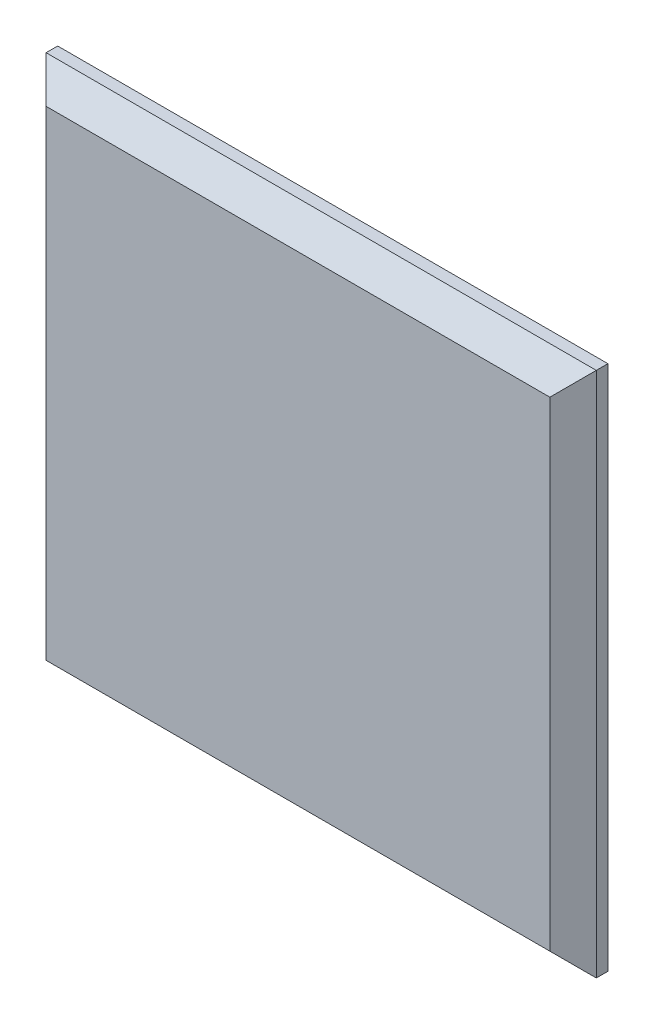
ISO-10303-21;
HEADER;
FILE_DESCRIPTION(('STEP AP214'),'2;1');
FILE_NAME('part.step','',(''),(''),'','','');
FILE_SCHEMA(('AUTOMOTIVE_DESIGN { 1 0 10303 214 1 1 1 1 }'));
ENDSEC;
DATA;
#1=APPLICATION_CONTEXT('core data for automotive mechanical design processes');
#2=APPLICATION_PROTOCOL_DEFINITION('international standard','automotive_design',2000,#1);
#3=PRODUCT_CONTEXT('',#1,'mechanical');
#4=PRODUCT('Part','Part','',(#3));
#5=PRODUCT_RELATED_PRODUCT_CATEGORY('part','',(#4));
#6=PRODUCT_DEFINITION_FORMATION('','',#4);
#7=PRODUCT_DEFINITION_CONTEXT('part definition',#1,'design');
#8=PRODUCT_DEFINITION('design','',#6,#7);
#9=PRODUCT_DEFINITION_SHAPE('','',#8);
#10=(LENGTH_UNIT() NAMED_UNIT(*) SI_UNIT(.MILLI.,.METRE.));
#11=(NAMED_UNIT(*) PLANE_ANGLE_UNIT() SI_UNIT($,.RADIAN.));
#12=(NAMED_UNIT(*) SI_UNIT($,.STERADIAN.) SOLID_ANGLE_UNIT());
#13=UNCERTAINTY_MEASURE_WITH_UNIT(LENGTH_MEASURE(1.E-05),#10,'distance_accuracy_value','');
#14=(GEOMETRIC_REPRESENTATION_CONTEXT(3) GLOBAL_UNCERTAINTY_ASSIGNED_CONTEXT((#13)) GLOBAL_UNIT_ASSIGNED_CONTEXT((#10,
#11,#12)) REPRESENTATION_CONTEXT('',''));
#15=CARTESIAN_POINT('',(0.,0.,0.));
#16=DIRECTION('',(0.,0.,1.));
#17=DIRECTION('',(1.,0.,0.));
#18=AXIS2_PLACEMENT_3D('',#15,#16,#17);
#19=CARTESIAN_POINT('',(0.,136.,6.));
#20=DIRECTION('',(0.,-1.,0.));
#21=DIRECTION('',(1.,0.,0.));
#22=AXIS2_PLACEMENT_3D('',#19,#20,#21);
#23=PLANE('',#22);
#24=DIRECTION('',(0.,0.,-1.));
#25=VECTOR('',#24,1.);
#26=CARTESIAN_POINT('',(-142.200000000008,136.,6.));
#27=LINE('',#26,#25);
#28=CARTESIAN_POINT('',(-142.200000000008,136.,2.99999999999999));
#29=VERTEX_POINT('',#28);
#30=CARTESIAN_POINT('',(-142.200000000008,136.,0.));
#31=VERTEX_POINT('',#30);
#32=EDGE_CURVE('E282',#29,#31,#27,.T.);
#33=ORIENTED_EDGE('',*,*,#32,.F.);
#34=DIRECTION('',(1.,0.,0.));
#35=VECTOR('',#34,1.);
#36=CARTESIAN_POINT('',(0.,136.,3.));
#37=LINE('',#36,#35);
#38=CARTESIAN_POINT('',(0.,136.,2.99999999999999));
#39=VERTEX_POINT('',#38);
#40=EDGE_CURVE('E317',#29,#39,#37,.T.);
#41=ORIENTED_EDGE('',*,*,#40,.T.);
#42=DIRECTION('',(0.,0.,-1.));
#43=VECTOR('',#42,1.);
#44=CARTESIAN_POINT('',(0.,136.,6.));
#45=LINE('',#44,#43);
#46=CARTESIAN_POINT('',(0.,136.,0.));
#47=VERTEX_POINT('',#46);
#48=EDGE_CURVE('E207',#39,#47,#45,.T.);
#49=ORIENTED_EDGE('',*,*,#48,.T.);
#50=DIRECTION('',(-1.,0.,0.));
#51=VECTOR('',#50,1.);
#52=CARTESIAN_POINT('',(0.,136.,0.));
#53=LINE('',#52,#51);
#54=EDGE_CURVE('E265',#47,#31,#53,.T.);
#55=ORIENTED_EDGE('',*,*,#54,.T.);
#56=EDGE_LOOP('',(#33,#41,#49,#55));
#57=FACE_BOUND('',#56,.T.);
#58=ADVANCED_FACE('F34',(#57),#23,.F.);
#59=CARTESIAN_POINT('',(-142.200000000008,0.,6.));
#60=DIRECTION('',(1.,0.,0.));
#61=DIRECTION('',(0.,0.,-1.));
#62=AXIS2_PLACEMENT_3D('',#59,#60,#61);
#63=PLANE('',#62);
#64=DIRECTION('',(0.,0.,-1.));
#65=VECTOR('',#64,1.);
#66=CARTESIAN_POINT('',(-142.200000000008,0.,6.));
#67=LINE('',#66,#65);
#68=CARTESIAN_POINT('',(-142.200000000008,0.,2.99999999999999));
#69=VERTEX_POINT('',#68);
#70=CARTESIAN_POINT('',(-142.200000000008,0.,0.));
#71=VERTEX_POINT('',#70);
#72=EDGE_CURVE('E280',#69,#71,#67,.T.);
#73=ORIENTED_EDGE('',*,*,#72,.F.);
#74=DIRECTION('',(0.,1.,0.));
#75=VECTOR('',#74,1.);
#76=CARTESIAN_POINT('',(-142.200000000008,136.,2.99999999999999));
#77=LINE('',#76,#75);
#78=EDGE_CURVE('E324',#69,#29,#77,.T.);
#79=ORIENTED_EDGE('',*,*,#78,.T.);
#80=ORIENTED_EDGE('',*,*,#32,.T.);
#81=DIRECTION('',(0.,-1.,0.));
#82=VECTOR('',#81,1.);
#83=CARTESIAN_POINT('',(-142.200000000008,0.,0.));
#84=LINE('',#83,#82);
#85=EDGE_CURVE('E268',#31,#71,#84,.T.);
#86=ORIENTED_EDGE('',*,*,#85,.T.);
#87=EDGE_LOOP('',(#73,#79,#80,#86));
#88=FACE_BOUND('',#87,.T.);
#89=ADVANCED_FACE('F440',(#88),#63,.F.);
#90=CARTESIAN_POINT('',(0.,0.,6.));
#91=DIRECTION('',(0.,1.,0.));
#92=DIRECTION('',(-1.,0.,0.));
#93=AXIS2_PLACEMENT_3D('',#90,#91,#92);
#94=PLANE('',#93);
#95=DIRECTION('',(0.,0.,-1.));
#96=VECTOR('',#95,1.);
#97=CARTESIAN_POINT('',(0.,0.,6.));
#98=LINE('',#97,#96);
#99=CARTESIAN_POINT('',(0.,0.,3.));
#100=VERTEX_POINT('',#99);
#101=CARTESIAN_POINT('',(0.,0.,0.));
#102=VERTEX_POINT('',#101);
#103=EDGE_CURVE('E278',#100,#102,#98,.T.);
#104=ORIENTED_EDGE('',*,*,#103,.F.);
#105=DIRECTION('',(-1.,0.,0.));
#106=VECTOR('',#105,1.);
#107=CARTESIAN_POINT('',(-142.200000000008,0.,3.));
#108=LINE('',#107,#106);
#109=EDGE_CURVE('E322',#100,#69,#108,.T.);
#110=ORIENTED_EDGE('',*,*,#109,.T.);
#111=ORIENTED_EDGE('',*,*,#72,.T.);
#112=DIRECTION('',(1.,0.,0.));
#113=VECTOR('',#112,1.);
#114=CARTESIAN_POINT('',(0.,0.,0.));
#115=LINE('',#114,#113);
#116=EDGE_CURVE('E271',#71,#102,#115,.T.);
#117=ORIENTED_EDGE('',*,*,#116,.T.);
#118=EDGE_LOOP('',(#104,#110,#111,#117));
#119=FACE_BOUND('',#118,.T.);
#120=ADVANCED_FACE('F446',(#119),#94,.F.);
#121=CARTESIAN_POINT('',(0.,126.5,6.));
#122=DIRECTION('',(0.,-1.,0.));
#123=DIRECTION('',(0.,0.,-1.));
#124=AXIS2_PLACEMENT_3D('',#121,#122,#123);
#125=PLANE('',#124);
#126=DIRECTION('',(0.,0.,-1.));
#127=VECTOR('',#126,1.);
#128=CARTESIAN_POINT('',(-135.700000000008,126.5,6.));
#129=LINE('',#128,#127);
#130=CARTESIAN_POINT('',(-135.700000000008,126.5,3.49999999999999));
#131=VERTEX_POINT('',#130);
#132=CARTESIAN_POINT('',(-135.700000000008,126.5,0.));
#133=VERTEX_POINT('',#132);
#134=EDGE_CURVE('E196',#131,#133,#129,.T.);
#135=ORIENTED_EDGE('',*,*,#134,.F.);
#136=DIRECTION('',(0.707106781186555,0.,0.70710678118654));
#137=VECTOR('',#136,1.);
#138=CARTESIAN_POINT('',(-66.6000000000025,126.5,72.6000000000038));
#139=LINE('',#138,#137);
#140=CARTESIAN_POINT('',(-137.200000000008,126.5,2.00000000000002));
#141=VERTEX_POINT('',#140);
#142=EDGE_CURVE('E361',#131,#141,#139,.F.);
#143=ORIENTED_EDGE('',*,*,#142,.T.);
#144=DIRECTION('',(0.,0.,-1.));
#145=VECTOR('',#144,1.);
#146=CARTESIAN_POINT('',(-137.200000000008,126.5,6.));
#147=LINE('',#146,#145);
#148=CARTESIAN_POINT('',(-137.200000000008,126.5,0.));
#149=VERTEX_POINT('',#148);
#150=EDGE_CURVE('E222',#141,#149,#147,.T.);
#151=ORIENTED_EDGE('',*,*,#150,.T.);
#152=DIRECTION('',(-1.,0.,0.));
#153=VECTOR('',#152,1.);
#154=CARTESIAN_POINT('',(0.,126.5,0.));
#155=LINE('',#154,#153);
#156=EDGE_CURVE('E215',#133,#149,#155,.T.);
#157=ORIENTED_EDGE('',*,*,#156,.F.);
#158=EDGE_LOOP('',(#135,#143,#151,#157));
#159=FACE_BOUND('',#158,.T.);
#160=ADVANCED_FACE('F220',(#159),#125,.T.);
#161=CARTESIAN_POINT('',(-135.700000000008,129.5,6.));
#162=DIRECTION('',(0.,0.,-1.));
#163=DIRECTION('',(-1.,0.,0.));
#164=AXIS2_PLACEMENT_3D('',#161,#162,#163);
#165=CYLINDRICAL_SURFACE('',#164,3.00000000000002);
#166=DIRECTION('',(0.,0.,-1.));
#167=VECTOR('',#166,1.);
#168=CARTESIAN_POINT('',(-132.700000000008,129.5,6.));
#169=LINE('',#168,#167);
#170=CARTESIAN_POINT('',(-132.700000000008,129.5,3.49999999999996));
#171=VERTEX_POINT('',#170);
#172=CARTESIAN_POINT('',(-132.700000000008,129.5,0.));
#173=VERTEX_POINT('',#172);
#174=EDGE_CURVE('E208',#171,#173,#169,.T.);
#175=ORIENTED_EDGE('',*,*,#174,.F.);
#176=CARTESIAN_POINT('',(-135.700000000008,129.5,3.49999999999996));
#177=DIRECTION('',(0.,0.707106781186552,0.707106781186542));
#178=DIRECTION('',(0.,0.707106781186543,-0.707106781186552));
#179=AXIS2_PLACEMENT_3D('',#176,#177,#178);
#180=ELLIPSE('',#179,4.24264068711935,3.00000000000002);
#181=CARTESIAN_POINT('',(-133.578679656448,127.37867965644,5.62132034355967));
#182=VERTEX_POINT('',#181);
#183=EDGE_CURVE('E338',#171,#182,#180,.F.);
#184=ORIENTED_EDGE('',*,*,#183,.T.);
#185=CARTESIAN_POINT('',(-135.700000000008,129.5,3.50000000000001));
#186=DIRECTION('',(0.70710678118654,0.,-0.707106781186555));
#187=DIRECTION('',(-0.707106781186555,0.,-0.70710678118654));
#188=AXIS2_PLACEMENT_3D('',#185,#186,#187);
#189=ELLIPSE('',#188,4.24264068711927,3.00000000000002);
#190=EDGE_CURVE('E203',#182,#131,#189,.T.);
#191=ORIENTED_EDGE('',*,*,#190,.T.);
#192=ORIENTED_EDGE('',*,*,#134,.T.);
#193=CARTESIAN_POINT('',(-135.700000000008,129.5,0.));
#194=DIRECTION('',(0.,0.,1.));
#195=DIRECTION('',(1.,0.,0.));
#196=AXIS2_PLACEMENT_3D('',#193,#194,#195);
#197=CIRCLE('',#196,3.00000000000002);
#198=EDGE_CURVE('E200',#133,#173,#197,.T.);
#199=ORIENTED_EDGE('',*,*,#198,.T.);
#200=EDGE_LOOP('',(#175,#184,#191,#192,#199));
#201=FACE_BOUND('',#200,.T.);
#202=ADVANCED_FACE('F199',(#201),#165,.T.);
#203=CARTESIAN_POINT('',(-132.700000000008,0.,6.));
#204=DIRECTION('',(-1.,0.,0.));
#205=DIRECTION('',(0.,0.,1.));
#206=AXIS2_PLACEMENT_3D('',#203,#204,#205);
#207=PLANE('',#206);
#208=DIRECTION('',(0.,0.,-1.));
#209=VECTOR('',#208,1.);
#210=CARTESIAN_POINT('',(-132.700000000008,131.,6.));
#211=LINE('',#210,#209);
#212=CARTESIAN_POINT('',(-132.700000000008,131.,1.99999999999993));
#213=VERTEX_POINT('',#212);
#214=CARTESIAN_POINT('',(-132.700000000008,131.,0.));
#215=VERTEX_POINT('',#214);
#216=EDGE_CURVE('E306',#213,#215,#211,.T.);
#217=ORIENTED_EDGE('',*,*,#216,.F.);
#218=DIRECTION('',(0.,-0.707106781186543,0.707106781186552));
#219=VECTOR('',#218,1.);
#220=CARTESIAN_POINT('',(-132.700000000008,131.,1.99999999999993));
#221=LINE('',#220,#219);
#222=EDGE_CURVE('E335',#213,#171,#221,.T.);
#223=ORIENTED_EDGE('',*,*,#222,.T.);
#224=ORIENTED_EDGE('',*,*,#174,.T.);
#225=DIRECTION('',(0.,1.,0.));
#226=VECTOR('',#225,1.);
#227=CARTESIAN_POINT('',(-132.700000000008,0.,0.));
#228=LINE('',#227,#226);
#229=EDGE_CURVE('E218',#173,#215,#228,.T.);
#230=ORIENTED_EDGE('',*,*,#229,.T.);
#231=EDGE_LOOP('',(#217,#223,#224,#230));
#232=FACE_BOUND('',#231,.T.);
#233=ADVANCED_FACE('F743',(#232),#207,.F.);
#234=CARTESIAN_POINT('',(0.,131.,6.));
#235=DIRECTION('',(0.,-1.,0.));
#236=DIRECTION('',(1.,0.,0.));
#237=AXIS2_PLACEMENT_3D('',#234,#235,#236);
#238=PLANE('',#237);
#239=DIRECTION('',(0.,0.,-1.));
#240=VECTOR('',#239,1.);
#241=CARTESIAN_POINT('',(-7.9999999999982,131.,6.));
#242=LINE('',#241,#240);
#243=CARTESIAN_POINT('',(-7.9999999999982,131.,1.99999999999994));
#244=VERTEX_POINT('',#243);
#245=CARTESIAN_POINT('',(-7.9999999999982,131.,0.));
#246=VERTEX_POINT('',#245);
#247=EDGE_CURVE('E304',#244,#246,#242,.T.);
#248=ORIENTED_EDGE('',*,*,#247,.F.);
#249=DIRECTION('',(-1.,0.,0.));
#250=VECTOR('',#249,1.);
#251=CARTESIAN_POINT('',(0.,131.,1.99999999999994));
#252=LINE('',#251,#250);
#253=EDGE_CURVE('E326',#244,#213,#252,.T.);
#254=ORIENTED_EDGE('',*,*,#253,.T.);
#255=ORIENTED_EDGE('',*,*,#216,.T.);
#256=DIRECTION('',(-1.,0.,0.));
#257=VECTOR('',#256,1.);
#258=CARTESIAN_POINT('',(0.,131.,0.));
#259=LINE('',#258,#257);
#260=EDGE_CURVE('E234',#246,#215,#259,.T.);
#261=ORIENTED_EDGE('',*,*,#260,.F.);
#262=EDGE_LOOP('',(#248,#254,#255,#261));
#263=FACE_BOUND('',#262,.T.);
#264=ADVANCED_FACE('F750',(#263),#238,.T.);
#265=CARTESIAN_POINT('',(-7.9999999999982,0.,6.));
#266=DIRECTION('',(-1.,0.,0.));
#267=DIRECTION('',(0.,0.,1.));
#268=AXIS2_PLACEMENT_3D('',#265,#266,#267);
#269=PLANE('',#268);
#270=DIRECTION('',(0.,0.,-1.));
#271=VECTOR('',#270,1.);
#272=CARTESIAN_POINT('',(-7.9999999999982,129.5,6.));
#273=LINE('',#272,#271);
#274=CARTESIAN_POINT('',(-7.9999999999982,129.5,3.49999999999997));
#275=VERTEX_POINT('',#274);
#276=CARTESIAN_POINT('',(-7.9999999999982,129.5,0.));
#277=VERTEX_POINT('',#276);
#278=EDGE_CURVE('E302',#275,#277,#273,.T.);
#279=ORIENTED_EDGE('',*,*,#278,.F.);
#280=DIRECTION('',(0.,0.707106781186543,-0.707106781186552));
#281=VECTOR('',#280,1.);
#282=CARTESIAN_POINT('',(-7.9999999999982,63.5000000000009,69.5));
#283=LINE('',#282,#281);
#284=EDGE_CURVE('E353',#275,#244,#283,.T.);
#285=ORIENTED_EDGE('',*,*,#284,.T.);
#286=ORIENTED_EDGE('',*,*,#247,.T.);
#287=DIRECTION('',(0.,1.,0.));
#288=VECTOR('',#287,1.);
#289=CARTESIAN_POINT('',(-7.9999999999982,0.,0.));
#290=LINE('',#289,#288);
#291=EDGE_CURVE('E236',#277,#246,#290,.T.);
#292=ORIENTED_EDGE('',*,*,#291,.F.);
#293=EDGE_LOOP('',(#279,#285,#286,#292));
#294=FACE_BOUND('',#293,.T.);
#295=ADVANCED_FACE('F758',(#294),#269,.T.);
#296=CARTESIAN_POINT('',(-4.9999999999982,129.5,6.));
#297=DIRECTION('',(0.,0.,-1.));
#298=DIRECTION('',(-1.,0.,0.));
#299=AXIS2_PLACEMENT_3D('',#296,#297,#298);
#300=CYLINDRICAL_SURFACE('',#299,3.);
#301=CARTESIAN_POINT('',(-4.9999999999982,129.5,1.99999999999994));
#302=DIRECTION('',(0.707106781186552,0.,0.707106781186542));
#303=DIRECTION('',(0.707106781186543,0.,-0.707106781186552));
#304=AXIS2_PLACEMENT_3D('',#301,#302,#303);
#305=ELLIPSE('',#304,4.24264068711932,3.);
#306=CARTESIAN_POINT('',(-4.9999999999982,126.5,1.99999999999994));
#307=VERTEX_POINT('',#306);
#308=CARTESIAN_POINT('',(-7.73431348329664,128.265686516702,4.73431348329842));
#309=VERTEX_POINT('',#308);
#310=EDGE_CURVE('E349',#307,#309,#305,.F.);
#311=ORIENTED_EDGE('',*,*,#310,.T.);
#312=CARTESIAN_POINT('',(-4.9999999999982,129.5,3.49999999999996));
#313=DIRECTION('',(0.,0.707106781186552,0.707106781186542));
#314=DIRECTION('',(0.,0.707106781186543,-0.707106781186552));
#315=AXIS2_PLACEMENT_3D('',#312,#313,#314);
#316=ELLIPSE('',#315,4.24264068711932,3.);
#317=EDGE_CURVE('E351',#309,#275,#316,.F.);
#318=ORIENTED_EDGE('',*,*,#317,.T.);
#319=ORIENTED_EDGE('',*,*,#278,.T.);
#320=CARTESIAN_POINT('',(-4.9999999999982,129.5,0.));
#321=DIRECTION('',(0.,0.,1.));
#322=DIRECTION('',(1.,0.,0.));
#323=AXIS2_PLACEMENT_3D('',#320,#321,#322);
#324=CIRCLE('',#323,3.);
#325=CARTESIAN_POINT('',(-4.9999999999982,126.5,0.));
#326=VERTEX_POINT('',#325);
#327=EDGE_CURVE('E239',#277,#326,#324,.T.);
#328=ORIENTED_EDGE('',*,*,#327,.T.);
#329=DIRECTION('',(0.,0.,-1.));
#330=VECTOR('',#329,1.);
#331=CARTESIAN_POINT('',(-4.9999999999982,126.5,6.));
#332=LINE('',#331,#330);
#333=EDGE_CURVE('E300',#307,#326,#332,.T.);
#334=ORIENTED_EDGE('',*,*,#333,.F.);
#335=EDGE_LOOP('',(#311,#318,#319,#328,#334));
#336=FACE_BOUND('',#335,.T.);
#337=ADVANCED_FACE('F766',(#336),#300,.T.);
#338=CARTESIAN_POINT('',(-4.9999999999982,0.,6.));
#339=DIRECTION('',(-1.,0.,0.));
#340=DIRECTION('',(0.,0.,1.));
#341=AXIS2_PLACEMENT_3D('',#338,#339,#340);
#342=PLANE('',#341);
#343=DIRECTION('',(0.,0.,-1.));
#344=VECTOR('',#343,1.);
#345=CARTESIAN_POINT('',(-4.9999999999982,9.5,6.));
#346=LINE('',#345,#344);
#347=CARTESIAN_POINT('',(-4.9999999999982,9.5,1.99999999999994));
#348=VERTEX_POINT('',#347);
#349=CARTESIAN_POINT('',(-4.9999999999982,9.5,0.));
#350=VERTEX_POINT('',#349);
#351=EDGE_CURVE('E298',#348,#350,#346,.T.);
#352=ORIENTED_EDGE('',*,*,#351,.F.);
#353=DIRECTION('',(0.,1.,0.));
#354=VECTOR('',#353,1.);
#355=CARTESIAN_POINT('',(-4.9999999999982,0.,1.99999999999994));
#356=LINE('',#355,#354);
#357=EDGE_CURVE('E355',#348,#307,#356,.T.);
#358=ORIENTED_EDGE('',*,*,#357,.T.);
#359=ORIENTED_EDGE('',*,*,#333,.T.);
#360=DIRECTION('',(0.,1.,0.));
#361=VECTOR('',#360,1.);
#362=CARTESIAN_POINT('',(-4.9999999999982,0.,0.));
#363=LINE('',#362,#361);
#364=EDGE_CURVE('E242',#350,#326,#363,.T.);
#365=ORIENTED_EDGE('',*,*,#364,.F.);
#366=EDGE_LOOP('',(#352,#358,#359,#365));
#367=FACE_BOUND('',#366,.T.);
#368=ADVANCED_FACE('F774',(#367),#342,.T.);
#369=CARTESIAN_POINT('',(-4.9999999999982,6.5,6.));
#370=DIRECTION('',(0.,0.,-1.));
#371=DIRECTION('',(-1.,0.,0.));
#372=AXIS2_PLACEMENT_3D('',#369,#370,#371);
#373=CYLINDRICAL_SURFACE('',#372,3.);
#374=CARTESIAN_POINT('',(-4.9999999999982,6.5,3.49999999999996));
#375=DIRECTION('',(0.,-0.707106781186552,0.707106781186543));
#376=DIRECTION('',(0.,-0.707106781186543,-0.707106781186552));
#377=AXIS2_PLACEMENT_3D('',#374,#375,#376);
#378=ELLIPSE('',#377,4.24264068711931,3.);
#379=CARTESIAN_POINT('',(-7.9999999999982,6.5,3.49999999999996));
#380=VERTEX_POINT('',#379);
#381=CARTESIAN_POINT('',(-7.73431348329664,7.73431348329844,4.73431348329842));
#382=VERTEX_POINT('',#381);
#383=EDGE_CURVE('E357',#380,#382,#378,.F.);
#384=ORIENTED_EDGE('',*,*,#383,.T.);
#385=CARTESIAN_POINT('',(-4.9999999999982,6.5,1.99999999999994));
#386=DIRECTION('',(0.707106781186552,0.,0.707106781186542));
#387=DIRECTION('',(0.707106781186543,0.,-0.707106781186552));
#388=AXIS2_PLACEMENT_3D('',#385,#386,#387);
#389=ELLIPSE('',#388,4.24264068711931,3.);
#390=EDGE_CURVE('E359',#382,#348,#389,.F.);
#391=ORIENTED_EDGE('',*,*,#390,.T.);
#392=ORIENTED_EDGE('',*,*,#351,.T.);
#393=CARTESIAN_POINT('',(-4.9999999999982,6.5,0.));
#394=DIRECTION('',(0.,0.,1.));
#395=DIRECTION('',(1.,0.,0.));
#396=AXIS2_PLACEMENT_3D('',#393,#394,#395);
#397=CIRCLE('',#396,3.);
#398=CARTESIAN_POINT('',(-7.9999999999982,6.5,0.));
#399=VERTEX_POINT('',#398);
#400=EDGE_CURVE('E245',#350,#399,#397,.T.);
#401=ORIENTED_EDGE('',*,*,#400,.T.);
#402=DIRECTION('',(0.,0.,-1.));
#403=VECTOR('',#402,1.);
#404=CARTESIAN_POINT('',(-7.9999999999982,6.5,6.));
#405=LINE('',#404,#403);
#406=EDGE_CURVE('E296',#380,#399,#405,.T.);
#407=ORIENTED_EDGE('',*,*,#406,.F.);
#408=EDGE_LOOP('',(#384,#391,#392,#401,#407));
#409=FACE_BOUND('',#408,.T.);
#410=ADVANCED_FACE('F424',(#409),#373,.T.);
#411=CARTESIAN_POINT('',(-7.9999999999982,0.,6.));
#412=DIRECTION('',(1.,0.,0.));
#413=DIRECTION('',(0.,0.,-1.));
#414=AXIS2_PLACEMENT_3D('',#411,#412,#413);
#415=PLANE('',#414);
#416=DIRECTION('',(0.,0.,-1.));
#417=VECTOR('',#416,1.);
#418=CARTESIAN_POINT('',(-7.9999999999982,5.,6.));
#419=LINE('',#418,#417);
#420=CARTESIAN_POINT('',(-7.9999999999982,5.,1.99999999999994));
#421=VERTEX_POINT('',#420);
#422=CARTESIAN_POINT('',(-7.9999999999982,5.,0.));
#423=VERTEX_POINT('',#422);
#424=EDGE_CURVE('E294',#421,#423,#419,.T.);
#425=ORIENTED_EDGE('',*,*,#424,.F.);
#426=DIRECTION('',(0.,0.707106781186543,0.707106781186552));
#427=VECTOR('',#426,1.);
#428=CARTESIAN_POINT('',(-7.9999999999982,5.,1.99999999999994));
#429=LINE('',#428,#427);
#430=EDGE_CURVE('E43',#421,#380,#429,.T.);
#431=ORIENTED_EDGE('',*,*,#430,.T.);
#432=ORIENTED_EDGE('',*,*,#406,.T.);
#433=DIRECTION('',(0.,-1.,0.));
#434=VECTOR('',#433,1.);
#435=CARTESIAN_POINT('',(-7.9999999999982,0.,0.));
#436=LINE('',#435,#434);
#437=EDGE_CURVE('E248',#399,#423,#436,.T.);
#438=ORIENTED_EDGE('',*,*,#437,.T.);
#439=EDGE_LOOP('',(#425,#431,#432,#438));
#440=FACE_BOUND('',#439,.T.);
#441=ADVANCED_FACE('F422',(#440),#415,.F.);
#442=CARTESIAN_POINT('',(0.,5.,6.));
#443=DIRECTION('',(0.,1.,0.));
#444=DIRECTION('',(0.,0.,1.));
#445=AXIS2_PLACEMENT_3D('',#442,#443,#444);
#446=PLANE('',#445);
#447=DIRECTION('',(0.,0.,-1.));
#448=VECTOR('',#447,1.);
#449=CARTESIAN_POINT('',(-132.700000000008,5.,6.));
#450=LINE('',#449,#448);
#451=CARTESIAN_POINT('',(-132.700000000008,5.,1.99999999999994));
#452=VERTEX_POINT('',#451);
#453=CARTESIAN_POINT('',(-132.700000000008,5.,0.));
#454=VERTEX_POINT('',#453);
#455=EDGE_CURVE('E292',#452,#454,#450,.T.);
#456=ORIENTED_EDGE('',*,*,#455,.F.);
#457=DIRECTION('',(1.,0.,0.));
#458=VECTOR('',#457,1.);
#459=CARTESIAN_POINT('',(0.,5.,1.99999999999994));
#460=LINE('',#459,#458);
#461=EDGE_CURVE('E51',#452,#421,#460,.T.);
#462=ORIENTED_EDGE('',*,*,#461,.T.);
#463=ORIENTED_EDGE('',*,*,#424,.T.);
#464=DIRECTION('',(1.,0.,0.));
#465=VECTOR('',#464,1.);
#466=CARTESIAN_POINT('',(0.,5.,0.));
#467=LINE('',#466,#465);
#468=EDGE_CURVE('E251',#454,#423,#467,.T.);
#469=ORIENTED_EDGE('',*,*,#468,.F.);
#470=EDGE_LOOP('',(#456,#462,#463,#469));
#471=FACE_BOUND('',#470,.T.);
#472=ADVANCED_FACE('F430',(#471),#446,.T.);
#473=CARTESIAN_POINT('',(-132.700000000008,0.,6.));
#474=DIRECTION('',(1.,0.,0.));
#475=DIRECTION('',(0.,0.,-1.));
#476=AXIS2_PLACEMENT_3D('',#473,#474,#475);
#477=PLANE('',#476);
#478=DIRECTION('',(0.,0.,-1.));
#479=VECTOR('',#478,1.);
#480=CARTESIAN_POINT('',(-132.700000000008,6.5,6.));
#481=LINE('',#480,#479);
#482=CARTESIAN_POINT('',(-132.700000000008,6.5,3.49999999999996));
#483=VERTEX_POINT('',#482);
#484=CARTESIAN_POINT('',(-132.700000000008,6.5,0.));
#485=VERTEX_POINT('',#484);
#486=EDGE_CURVE('E290',#483,#485,#481,.T.);
#487=ORIENTED_EDGE('',*,*,#486,.F.);
#488=DIRECTION('',(0.,-0.707106781186543,-0.707106781186552));
#489=VECTOR('',#488,1.);
#490=CARTESIAN_POINT('',(-132.700000000008,4.50000000000006,1.5));
#491=LINE('',#490,#489);
#492=EDGE_CURVE('E11',#483,#452,#491,.T.);
#493=ORIENTED_EDGE('',*,*,#492,.T.);
#494=ORIENTED_EDGE('',*,*,#455,.T.);
#495=DIRECTION('',(0.,-1.,0.));
#496=VECTOR('',#495,1.);
#497=CARTESIAN_POINT('',(-132.700000000008,0.,0.));
#498=LINE('',#497,#496);
#499=EDGE_CURVE('E254',#485,#454,#498,.T.);
#500=ORIENTED_EDGE('',*,*,#499,.F.);
#501=EDGE_LOOP('',(#487,#493,#494,#500));
#502=FACE_BOUND('',#501,.T.);
#503=ADVANCED_FACE('F419',(#502),#477,.T.);
#504=CARTESIAN_POINT('',(-135.700000000008,6.5,6.));
#505=DIRECTION('',(0.,0.,-1.));
#506=DIRECTION('',(-1.,0.,0.));
#507=AXIS2_PLACEMENT_3D('',#504,#505,#506);
#508=CYLINDRICAL_SURFACE('',#507,2.99999999999999);
#509=DIRECTION('',(0.,0.,-1.));
#510=VECTOR('',#509,1.);
#511=CARTESIAN_POINT('',(-135.700000000008,9.5,6.));
#512=LINE('',#511,#510);
#513=CARTESIAN_POINT('',(-135.700000000008,9.5,3.50000000000056));
#514=VERTEX_POINT('',#513);
#515=CARTESIAN_POINT('',(-135.700000000008,9.5,0.));
#516=VERTEX_POINT('',#515);
#517=EDGE_CURVE('E288',#514,#516,#512,.T.);
#518=ORIENTED_EDGE('',*,*,#517,.F.);
#519=CARTESIAN_POINT('',(-135.700000000008,6.5,3.50000000000057));
#520=DIRECTION('',(0.70710678118654,0.,-0.707106781186555));
#521=DIRECTION('',(-0.707106781186555,0.,-0.70710678118654));
#522=AXIS2_PLACEMENT_3D('',#519,#520,#521);
#523=ELLIPSE('',#522,4.24264068711923,2.99999999999999);
#524=CARTESIAN_POINT('',(-133.578679656448,8.62132034355989,5.62132034355988));
#525=VERTEX_POINT('',#524);
#526=EDGE_CURVE('E369',#514,#525,#523,.T.);
#527=ORIENTED_EDGE('',*,*,#526,.T.);
#528=CARTESIAN_POINT('',(-135.700000000008,6.5,3.49999999999996));
#529=DIRECTION('',(0.,-0.707106781186552,0.707106781186543));
#530=DIRECTION('',(0.,-0.707106781186543,-0.707106781186552));
#531=AXIS2_PLACEMENT_3D('',#528,#529,#530);
#532=ELLIPSE('',#531,4.24264068711931,2.99999999999999);
#533=EDGE_CURVE('E367',#525,#483,#532,.F.);
#534=ORIENTED_EDGE('',*,*,#533,.T.);
#535=ORIENTED_EDGE('',*,*,#486,.T.);
#536=CARTESIAN_POINT('',(-135.700000000008,6.5,0.));
#537=DIRECTION('',(0.,0.,1.));
#538=DIRECTION('',(1.,0.,0.));
#539=AXIS2_PLACEMENT_3D('',#536,#537,#538);
#540=CIRCLE('',#539,2.99999999999999);
#541=EDGE_CURVE('E257',#485,#516,#540,.T.);
#542=ORIENTED_EDGE('',*,*,#541,.T.);
#543=EDGE_LOOP('',(#518,#527,#534,#535,#542));
#544=FACE_BOUND('',#543,.T.);
#545=ADVANCED_FACE('F418',(#544),#508,.T.);
#546=CARTESIAN_POINT('',(0.,9.5,6.));
#547=DIRECTION('',(0.,-1.,0.));
#548=DIRECTION('',(0.,0.,-1.));
#549=AXIS2_PLACEMENT_3D('',#546,#547,#548);
#550=PLANE('',#549);
#551=DIRECTION('',(0.,0.,-1.));
#552=VECTOR('',#551,1.);
#553=CARTESIAN_POINT('',(-137.200000000008,9.5,6.));
#554=LINE('',#553,#552);
#555=CARTESIAN_POINT('',(-137.200000000008,9.5,2.00000000000031));
#556=VERTEX_POINT('',#555);
#557=CARTESIAN_POINT('',(-137.200000000008,9.5,0.));
#558=VERTEX_POINT('',#557);
#559=EDGE_CURVE('E286',#556,#558,#554,.T.);
#560=ORIENTED_EDGE('',*,*,#559,.F.);
#561=DIRECTION('',(-0.707106781186555,0.,-0.70710678118654));
#562=VECTOR('',#561,1.);
#563=CARTESIAN_POINT('',(-133.200000000008,9.5,5.99999999999998));
#564=LINE('',#563,#562);
#565=EDGE_CURVE('E365',#556,#514,#564,.F.);
#566=ORIENTED_EDGE('',*,*,#565,.T.);
#567=ORIENTED_EDGE('',*,*,#517,.T.);
#568=DIRECTION('',(-1.,0.,0.));
#569=VECTOR('',#568,1.);
#570=CARTESIAN_POINT('',(0.,9.5,0.));
#571=LINE('',#570,#569);
#572=EDGE_CURVE('E260',#516,#558,#571,.T.);
#573=ORIENTED_EDGE('',*,*,#572,.T.);
#574=EDGE_LOOP('',(#560,#566,#567,#573));
#575=FACE_BOUND('',#574,.T.);
#576=ADVANCED_FACE('F415',(#575),#550,.F.);
#577=CARTESIAN_POINT('',(-137.200000000008,6.34677495744086E-13,6.));
#578=DIRECTION('',(-1.,0.,0.));
#579=DIRECTION('',(0.,-1.,0.));
#580=AXIS2_PLACEMENT_3D('',#577,#578,#579);
#581=PLANE('',#580);
#582=ORIENTED_EDGE('',*,*,#150,.F.);
#583=DIRECTION('',(0.,-1.,0.));
#584=VECTOR('',#583,1.);
#585=CARTESIAN_POINT('',(-137.200000000008,9.5,2.00000000000002));
#586=LINE('',#585,#584);
#587=EDGE_CURVE('E363',#141,#556,#586,.T.);
#588=ORIENTED_EDGE('',*,*,#587,.T.);
#589=ORIENTED_EDGE('',*,*,#559,.T.);
#590=DIRECTION('',(0.,1.,0.));
#591=VECTOR('',#590,1.);
#592=CARTESIAN_POINT('',(-137.200000000008,6.34677495744086E-13,0.));
#593=LINE('',#592,#591);
#594=EDGE_CURVE('E263',#558,#149,#593,.T.);
#595=ORIENTED_EDGE('',*,*,#594,.T.);
#596=EDGE_LOOP('',(#582,#588,#589,#595));
#597=FACE_BOUND('',#596,.T.);
#598=ADVANCED_FACE('F409',(#597),#581,.F.);
#599=CARTESIAN_POINT('',(0.,0.,6.));
#600=DIRECTION('',(-1.,0.,0.));
#601=DIRECTION('',(0.,-1.,0.));
#602=AXIS2_PLACEMENT_3D('',#599,#600,#601);
#603=PLANE('',#602);
#604=ORIENTED_EDGE('',*,*,#48,.F.);
#605=DIRECTION('',(0.,-1.,0.));
#606=VECTOR('',#605,1.);
#607=CARTESIAN_POINT('',(0.,0.,2.99999999999999));
#608=LINE('',#607,#606);
#609=EDGE_CURVE('E320',#39,#100,#608,.T.);
#610=ORIENTED_EDGE('',*,*,#609,.T.);
#611=ORIENTED_EDGE('',*,*,#103,.T.);
#612=DIRECTION('',(0.,1.,0.));
#613=VECTOR('',#612,1.);
#614=CARTESIAN_POINT('',(0.,0.,0.));
#615=LINE('',#614,#613);
#616=EDGE_CURVE('E274',#102,#47,#615,.T.);
#617=ORIENTED_EDGE('',*,*,#616,.T.);
#618=EDGE_LOOP('',(#604,#610,#611,#617));
#619=FACE_BOUND('',#618,.T.);
#620=ADVANCED_FACE('F454',(#619),#603,.F.);
#621=CARTESIAN_POINT('',(0.,0.,0.));
#622=DIRECTION('',(0.,0.,1.));
#623=DIRECTION('',(1.,0.,0.));
#624=AXIS2_PLACEMENT_3D('',#621,#622,#623);
#625=PLANE('',#624);
#626=CARTESIAN_POINT('',(-4.9999999999982,129.5,0.));
#627=DIRECTION('',(0.,0.,-1.));
#628=DIRECTION('',(-1.,0.,0.));
#629=AXIS2_PLACEMENT_3D('',#626,#627,#628);
#630=CIRCLE('',#629,1.55);
#631=CARTESIAN_POINT('',(-6.5499999999982,129.5,0.));
#632=VERTEX_POINT('',#631);
#633=EDGE_CURVE('E863',#632,#632,#630,.T.);
#634=ORIENTED_EDGE('',*,*,#633,.F.);
#635=EDGE_LOOP('',(#634));
#636=FACE_BOUND('',#635,.T.);
#637=CARTESIAN_POINT('',(-4.9999999999982,6.5,0.));
#638=DIRECTION('',(0.,0.,-1.));
#639=DIRECTION('',(-1.,0.,0.));
#640=AXIS2_PLACEMENT_3D('',#637,#638,#639);
#641=CIRCLE('',#640,1.55);
#642=CARTESIAN_POINT('',(-6.5499999999982,6.5,0.));
#643=VERTEX_POINT('',#642);
#644=EDGE_CURVE('E862',#643,#643,#641,.T.);
#645=ORIENTED_EDGE('',*,*,#644,.F.);
#646=EDGE_LOOP('',(#645));
#647=FACE_BOUND('',#646,.T.);
#648=CARTESIAN_POINT('',(-135.700000000008,6.5,0.));
#649=DIRECTION('',(0.,0.,-1.));
#650=DIRECTION('',(-1.,0.,0.));
#651=AXIS2_PLACEMENT_3D('',#648,#649,#650);
#652=CIRCLE('',#651,1.54999999999999);
#653=CARTESIAN_POINT('',(-137.250000000008,6.5,0.));
#654=VERTEX_POINT('',#653);
#655=EDGE_CURVE('E872',#654,#654,#652,.T.);
#656=ORIENTED_EDGE('',*,*,#655,.F.);
#657=EDGE_LOOP('',(#656));
#658=FACE_BOUND('',#657,.T.);
#659=CARTESIAN_POINT('',(-135.700000000008,129.5,0.));
#660=DIRECTION('',(0.,0.,-1.));
#661=DIRECTION('',(-1.,0.,0.));
#662=AXIS2_PLACEMENT_3D('',#659,#660,#661);
#663=CIRCLE('',#662,1.54999999999999);
#664=CARTESIAN_POINT('',(-137.250000000008,129.5,0.));
#665=VERTEX_POINT('',#664);
#666=EDGE_CURVE('E230',#665,#665,#663,.T.);
#667=ORIENTED_EDGE('',*,*,#666,.F.);
#668=EDGE_LOOP('',(#667));
#669=FACE_BOUND('',#668,.T.);
#670=ORIENTED_EDGE('',*,*,#156,.T.);
#671=ORIENTED_EDGE('',*,*,#594,.F.);
#672=ORIENTED_EDGE('',*,*,#572,.F.);
#673=ORIENTED_EDGE('',*,*,#541,.F.);
#674=ORIENTED_EDGE('',*,*,#499,.T.);
#675=ORIENTED_EDGE('',*,*,#468,.T.);
#676=ORIENTED_EDGE('',*,*,#437,.F.);
#677=ORIENTED_EDGE('',*,*,#400,.F.);
#678=ORIENTED_EDGE('',*,*,#364,.T.);
#679=ORIENTED_EDGE('',*,*,#327,.F.);
#680=ORIENTED_EDGE('',*,*,#291,.T.);
#681=ORIENTED_EDGE('',*,*,#260,.T.);
#682=ORIENTED_EDGE('',*,*,#229,.F.);
#683=ORIENTED_EDGE('',*,*,#198,.F.);
#684=EDGE_LOOP('',(#670,#671,#672,#673,#674,#675,#676,#677,#678,#679,#680,#681,#682,#683));
#685=FACE_BOUND('',#684,.T.);
#686=ORIENTED_EDGE('',*,*,#54,.F.);
#687=ORIENTED_EDGE('',*,*,#616,.F.);
#688=ORIENTED_EDGE('',*,*,#116,.F.);
#689=ORIENTED_EDGE('',*,*,#85,.F.);
#690=EDGE_LOOP('',(#686,#687,#688,#689));
#691=FACE_BOUND('',#690,.T.);
#692=ADVANCED_FACE('F212',(#636,#647,#658,#669,#685,#691),#625,.F.);
#693=CARTESIAN_POINT('',(0.,0.,9.));
#694=DIRECTION('',(0.,0.,1.));
#695=DIRECTION('',(1.,0.,0.));
#696=AXIS2_PLACEMENT_3D('',#693,#694,#695);
#697=PLANE('',#696);
#698=DIRECTION('',(0.,1.,0.));
#699=VECTOR('',#698,1.);
#700=CARTESIAN_POINT('',(-5.99999999999992,136.,9.));
#701=LINE('',#700,#699);
#702=CARTESIAN_POINT('',(-5.99999999999998,5.99999999999998,9.));
#703=VERTEX_POINT('',#702);
#704=CARTESIAN_POINT('',(-5.99999999999992,130.,9.));
#705=VERTEX_POINT('',#704);
#706=EDGE_CURVE('E312',#703,#705,#701,.T.);
#707=ORIENTED_EDGE('',*,*,#706,.T.);
#708=DIRECTION('',(-1.,0.,0.));
#709=VECTOR('',#708,1.);
#710=CARTESIAN_POINT('',(-142.200000000008,130.,9.));
#711=LINE('',#710,#709);
#712=CARTESIAN_POINT('',(-136.200000000008,130.,9.));
#713=VERTEX_POINT('',#712);
#714=EDGE_CURVE('E314',#705,#713,#711,.T.);
#715=ORIENTED_EDGE('',*,*,#714,.T.);
#716=DIRECTION('',(0.,-1.,0.));
#717=VECTOR('',#716,1.);
#718=CARTESIAN_POINT('',(-136.200000000008,0.,9.));
#719=LINE('',#718,#717);
#720=CARTESIAN_POINT('',(-136.200000000008,5.99999999999998,9.));
#721=VERTEX_POINT('',#720);
#722=EDGE_CURVE('E284',#713,#721,#719,.T.);
#723=ORIENTED_EDGE('',*,*,#722,.T.);
#724=DIRECTION('',(1.,0.,0.));
#725=VECTOR('',#724,1.);
#726=CARTESIAN_POINT('',(0.,5.99999999999998,9.));
#727=LINE('',#726,#725);
#728=EDGE_CURVE('E310',#721,#703,#727,.T.);
#729=ORIENTED_EDGE('',*,*,#728,.T.);
#730=EDGE_LOOP('',(#707,#715,#723,#729));
#731=FACE_BOUND('',#730,.T.);
#732=ADVANCED_FACE('F486',(#731),#697,.T.);
#733=CARTESIAN_POINT('',(0.,0.,6.));
#734=DIRECTION('',(0.,0.,1.));
#735=DIRECTION('',(1.,0.,0.));
#736=AXIS2_PLACEMENT_3D('',#733,#734,#735);
#737=PLANE('',#736);
#738=DIRECTION('',(0.,1.,0.));
#739=VECTOR('',#738,1.);
#740=CARTESIAN_POINT('',(-133.200000000008,126.5,6.));
#741=LINE('',#740,#739);
#742=CARTESIAN_POINT('',(-133.200000000008,9.00000000000001,6.));
#743=VERTEX_POINT('',#742);
#744=CARTESIAN_POINT('',(-133.200000000008,127.,6.));
#745=VERTEX_POINT('',#744);
#746=EDGE_CURVE('E342',#743,#745,#741,.T.);
#747=ORIENTED_EDGE('',*,*,#746,.T.);
#748=DIRECTION('',(1.,0.,0.));
#749=VECTOR('',#748,1.);
#750=CARTESIAN_POINT('',(0.,127.,6.));
#751=LINE('',#750,#749);
#752=CARTESIAN_POINT('',(-8.9999999999982,127.,6.));
#753=VERTEX_POINT('',#752);
#754=EDGE_CURVE('E346',#745,#753,#751,.T.);
#755=ORIENTED_EDGE('',*,*,#754,.T.);
#756=DIRECTION('',(0.,-1.,0.));
#757=VECTOR('',#756,1.);
#758=CARTESIAN_POINT('',(-8.9999999999982,0.,6.));
#759=LINE('',#758,#757);
#760=CARTESIAN_POINT('',(-8.9999999999982,9.00000000000001,6.));
#761=VERTEX_POINT('',#760);
#762=EDGE_CURVE('E344',#753,#761,#759,.T.);
#763=ORIENTED_EDGE('',*,*,#762,.T.);
#764=DIRECTION('',(-1.,0.,0.));
#765=VECTOR('',#764,1.);
#766=CARTESIAN_POINT('',(0.,9.00000000000001,6.));
#767=LINE('',#766,#765);
#768=EDGE_CURVE('E340',#761,#743,#767,.T.);
#769=ORIENTED_EDGE('',*,*,#768,.T.);
#770=EDGE_LOOP('',(#747,#755,#763,#769));
#771=FACE_BOUND('',#770,.T.);
#772=ADVANCED_FACE('F398',(#771),#737,.F.);
#773=CARTESIAN_POINT('',(0.,5.99999999999998,9.));
#774=DIRECTION('',(0.,-0.707106781186549,0.707106781186546));
#775=DIRECTION('',(-1.,0.,0.));
#776=AXIS2_PLACEMENT_3D('',#773,#774,#775);
#777=PLANE('',#776);
#778=DIRECTION('',(0.577350269189625,0.577350269189625,0.577350269189628));
#779=VECTOR('',#778,1.);
#780=CARTESIAN_POINT('',(-138.200000000008,3.99999999999999,7.));
#781=LINE('',#780,#779);
#782=EDGE_CURVE('E227',#69,#721,#781,.T.);
#783=ORIENTED_EDGE('',*,*,#782,.F.);
#784=ORIENTED_EDGE('',*,*,#109,.F.);
#785=DIRECTION('',(-0.577350269189625,0.577350269189625,0.577350269189628));
#786=VECTOR('',#785,1.);
#787=CARTESIAN_POINT('',(-3.99999999999999,3.99999999999999,7.00000000000001));
#788=LINE('',#787,#786);
#789=EDGE_CURVE('E224',#703,#100,#788,.F.);
#790=ORIENTED_EDGE('',*,*,#789,.F.);
#791=ORIENTED_EDGE('',*,*,#728,.F.);
#792=EDGE_LOOP('',(#783,#784,#790,#791));
#793=FACE_BOUND('',#792,.T.);
#794=ADVANCED_FACE('F502',(#793),#777,.T.);
#795=CARTESIAN_POINT('',(-5.99999999999998,0.,9.));
#796=DIRECTION('',(0.707106781186549,0.,0.707106781186546));
#797=DIRECTION('',(0.,-1.,0.));
#798=AXIS2_PLACEMENT_3D('',#795,#796,#797);
#799=PLANE('',#798);
#800=ORIENTED_EDGE('',*,*,#789,.T.);
#801=ORIENTED_EDGE('',*,*,#609,.F.);
#802=DIRECTION('',(-0.577350269189626,-0.577350269189623,0.577350269189628));
#803=VECTOR('',#802,1.);
#804=CARTESIAN_POINT('',(-49.3333333333331,86.6666666666671,52.3333333333334));
#805=LINE('',#804,#803);
#806=EDGE_CURVE('E329',#705,#39,#805,.F.);
#807=ORIENTED_EDGE('',*,*,#806,.F.);
#808=ORIENTED_EDGE('',*,*,#706,.F.);
#809=EDGE_LOOP('',(#800,#801,#807,#808));
#810=FACE_BOUND('',#809,.T.);
#811=ADVANCED_FACE('F509',(#810),#799,.T.);
#812=CARTESIAN_POINT('',(-136.200000000008,0.,9.));
#813=DIRECTION('',(-0.707106781186549,0.,0.707106781186546));
#814=DIRECTION('',(0.,1.,0.));
#815=AXIS2_PLACEMENT_3D('',#812,#813,#814);
#816=PLANE('',#815);
#817=ORIENTED_EDGE('',*,*,#782,.T.);
#818=ORIENTED_EDGE('',*,*,#722,.F.);
#819=DIRECTION('',(-0.577350269189626,0.577350269189623,-0.577350269189629));
#820=VECTOR('',#819,1.);
#821=CARTESIAN_POINT('',(-92.8666666666746,86.6666666666671,52.3333333333333));
#822=LINE('',#821,#820);
#823=EDGE_CURVE('E327',#29,#713,#822,.F.);
#824=ORIENTED_EDGE('',*,*,#823,.F.);
#825=ORIENTED_EDGE('',*,*,#78,.F.);
#826=EDGE_LOOP('',(#817,#818,#824,#825));
#827=FACE_BOUND('',#826,.T.);
#828=ADVANCED_FACE('F517',(#827),#816,.T.);
#829=CARTESIAN_POINT('',(0.,130.,9.));
#830=DIRECTION('',(0.,0.707106781186551,0.707106781186544));
#831=DIRECTION('',(1.,0.,0.));
#832=AXIS2_PLACEMENT_3D('',#829,#830,#831);
#833=PLANE('',#832);
#834=ORIENTED_EDGE('',*,*,#806,.T.);
#835=ORIENTED_EDGE('',*,*,#40,.F.);
#836=ORIENTED_EDGE('',*,*,#823,.T.);
#837=ORIENTED_EDGE('',*,*,#714,.F.);
#838=EDGE_LOOP('',(#834,#835,#836,#837));
#839=FACE_BOUND('',#838,.T.);
#840=ADVANCED_FACE('F525',(#839),#833,.T.);
#841=CARTESIAN_POINT('',(0.,5.,1.99999999999994));
#842=DIRECTION('',(0.,-0.707106781186552,0.707106781186543));
#843=DIRECTION('',(1.,0.,0.));
#844=AXIS2_PLACEMENT_3D('',#841,#842,#843);
#845=PLANE('',#844);
#846=DIRECTION('',(0.577350269189638,0.577350269189616,0.577350269189624));
#847=VECTOR('',#846,1.);
#848=CARTESIAN_POINT('',(-91.4666666666703,50.7333333333363,47.7333333333369));
#849=LINE('',#848,#847);
#850=EDGE_CURVE('E378',#743,#525,#849,.F.);
#851=ORIENTED_EDGE('',*,*,#850,.F.);
#852=ORIENTED_EDGE('',*,*,#768,.F.);
#853=DIRECTION('',(0.577350269189623,-0.577350269189623,-0.577350269189631));
#854=VECTOR('',#853,1.);
#855=CARTESIAN_POINT('',(-3.33333333333155,3.33333333333335,0.333333333333267));
#856=LINE('',#855,#854);
#857=EDGE_CURVE('E38',#382,#761,#856,.F.);
#858=ORIENTED_EDGE('',*,*,#857,.F.);
#859=ORIENTED_EDGE('',*,*,#383,.F.);
#860=ORIENTED_EDGE('',*,*,#430,.F.);
#861=ORIENTED_EDGE('',*,*,#461,.F.);
#862=ORIENTED_EDGE('',*,*,#492,.F.);
#863=ORIENTED_EDGE('',*,*,#533,.F.);
#864=EDGE_LOOP('',(#851,#852,#858,#859,#860,#861,#862,#863));
#865=FACE_BOUND('',#864,.T.);
#866=ADVANCED_FACE('F36',(#865),#845,.F.);
#867=CARTESIAN_POINT('',(-4.9999999999982,0.,1.99999999999994));
#868=DIRECTION('',(0.707106781186552,0.,0.707106781186542));
#869=DIRECTION('',(0.,1.,0.));
#870=AXIS2_PLACEMENT_3D('',#867,#868,#869);
#871=PLANE('',#870);
#872=ORIENTED_EDGE('',*,*,#857,.T.);
#873=ORIENTED_EDGE('',*,*,#762,.F.);
#874=DIRECTION('',(0.577350269189623,0.577350269189623,-0.577350269189631));
#875=VECTOR('',#874,1.);
#876=CARTESIAN_POINT('',(-3.33333333333216,132.666666666666,0.333333333333875));
#877=LINE('',#876,#875);
#878=EDGE_CURVE('E376',#309,#753,#877,.F.);
#879=ORIENTED_EDGE('',*,*,#878,.F.);
#880=ORIENTED_EDGE('',*,*,#310,.F.);
#881=ORIENTED_EDGE('',*,*,#357,.F.);
#882=ORIENTED_EDGE('',*,*,#390,.F.);
#883=EDGE_LOOP('',(#872,#873,#879,#880,#881,#882));
#884=FACE_BOUND('',#883,.T.);
#885=ADVANCED_FACE('F389',(#884),#871,.F.);
#886=CARTESIAN_POINT('',(-133.200000000008,6.16173778667E-13,6.));
#887=DIRECTION('',(0.70710678118654,0.,-0.707106781186555));
#888=DIRECTION('',(0.,-1.,0.));
#889=AXIS2_PLACEMENT_3D('',#886,#887,#888);
#890=PLANE('',#889);
#891=ORIENTED_EDGE('',*,*,#142,.F.);
#892=ORIENTED_EDGE('',*,*,#190,.F.);
#893=DIRECTION('',(0.577350269189635,-0.577350269189617,0.577350269189625));
#894=VECTOR('',#893,1.);
#895=CARTESIAN_POINT('',(-90.8666666666747,84.6666666666683,48.3333333333323));
#896=LINE('',#895,#894);
#897=EDGE_CURVE('E373',#745,#182,#896,.F.);
#898=ORIENTED_EDGE('',*,*,#897,.F.);
#899=ORIENTED_EDGE('',*,*,#746,.F.);
#900=ORIENTED_EDGE('',*,*,#850,.T.);
#901=ORIENTED_EDGE('',*,*,#526,.F.);
#902=ORIENTED_EDGE('',*,*,#565,.F.);
#903=ORIENTED_EDGE('',*,*,#587,.F.);
#904=EDGE_LOOP('',(#891,#892,#898,#899,#900,#901,#902,#903));
#905=FACE_BOUND('',#904,.T.);
#906=ADVANCED_FACE('F405',(#905),#890,.T.);
#907=CARTESIAN_POINT('',(0.,131.,1.99999999999994));
#908=DIRECTION('',(0.,0.707106781186552,0.707106781186542));
#909=DIRECTION('',(-1.,0.,0.));
#910=AXIS2_PLACEMENT_3D('',#907,#908,#909);
#911=PLANE('',#910);
#912=ORIENTED_EDGE('',*,*,#878,.T.);
#913=ORIENTED_EDGE('',*,*,#754,.F.);
#914=ORIENTED_EDGE('',*,*,#897,.T.);
#915=ORIENTED_EDGE('',*,*,#183,.F.);
#916=ORIENTED_EDGE('',*,*,#222,.F.);
#917=ORIENTED_EDGE('',*,*,#253,.F.);
#918=ORIENTED_EDGE('',*,*,#284,.F.);
#919=ORIENTED_EDGE('',*,*,#317,.F.);
#920=EDGE_LOOP('',(#912,#913,#914,#915,#916,#917,#918,#919));
#921=FACE_BOUND('',#920,.T.);
#922=ADVANCED_FACE('F402',(#921),#911,.F.);
#923=CARTESIAN_POINT('',(-135.700000000008,129.5,2.3));
#924=DIRECTION('',(0.,0.,-1.));
#925=DIRECTION('',(-1.,0.,0.));
#926=AXIS2_PLACEMENT_3D('',#923,#924,#925);
#927=CYLINDRICAL_SURFACE('',#926,1.54999999999999);
#928=CARTESIAN_POINT('',(-135.700000000008,129.5,2.3));
#929=DIRECTION('',(0.,0.,-1.));
#930=DIRECTION('',(-1.,0.,0.));
#931=AXIS2_PLACEMENT_3D('',#928,#929,#930);
#932=CIRCLE('',#931,1.54999999999999);
#933=CARTESIAN_POINT('',(-137.250000000008,129.5,2.3));
#934=VERTEX_POINT('',#933);
#935=EDGE_CURVE('E377',#934,#934,#932,.T.);
#936=ORIENTED_EDGE('',*,*,#935,.F.);
#937=EDGE_LOOP('',(#936));
#938=FACE_BOUND('',#937,.T.);
#939=ORIENTED_EDGE('',*,*,#666,.T.);
#940=EDGE_LOOP('',(#939));
#941=FACE_BOUND('',#940,.T.);
#942=ADVANCED_FACE('F555',(#938,#941),#927,.F.);
#943=CARTESIAN_POINT('',(-135.700000000008,129.5,2.3));
#944=DIRECTION('',(0.,0.,-1.));
#945=DIRECTION('',(-1.,0.,0.));
#946=AXIS2_PLACEMENT_3D('',#943,#944,#945);
#947=PLANE('',#946);
#948=ORIENTED_EDGE('',*,*,#935,.T.);
#949=EDGE_LOOP('',(#948));
#950=FACE_BOUND('',#949,.T.);
#951=ADVANCED_FACE('F561',(#950),#947,.T.);
#952=CARTESIAN_POINT('',(-135.700000000008,6.5,2.3));
#953=DIRECTION('',(0.,0.,-1.));
#954=DIRECTION('',(-1.,0.,0.));
#955=AXIS2_PLACEMENT_3D('',#952,#953,#954);
#956=CYLINDRICAL_SURFACE('',#955,1.54999999999999);
#957=CARTESIAN_POINT('',(-135.700000000008,6.5,2.3));
#958=DIRECTION('',(0.,0.,-1.));
#959=DIRECTION('',(-1.,0.,0.));
#960=AXIS2_PLACEMENT_3D('',#957,#958,#959);
#961=CIRCLE('',#960,1.54999999999999);
#962=CARTESIAN_POINT('',(-137.250000000008,6.5,2.3));
#963=VERTEX_POINT('',#962);
#964=EDGE_CURVE('E874',#963,#963,#961,.T.);
#965=ORIENTED_EDGE('',*,*,#964,.F.);
#966=EDGE_LOOP('',(#965));
#967=FACE_BOUND('',#966,.T.);
#968=ORIENTED_EDGE('',*,*,#655,.T.);
#969=EDGE_LOOP('',(#968));
#970=FACE_BOUND('',#969,.T.);
#971=ADVANCED_FACE('F569',(#967,#970),#956,.F.);
#972=CARTESIAN_POINT('',(-135.700000000008,6.5,2.3));
#973=DIRECTION('',(0.,0.,-1.));
#974=DIRECTION('',(-1.,0.,0.));
#975=AXIS2_PLACEMENT_3D('',#972,#973,#974);
#976=PLANE('',#975);
#977=ORIENTED_EDGE('',*,*,#964,.T.);
#978=EDGE_LOOP('',(#977));
#979=FACE_BOUND('',#978,.T.);
#980=ADVANCED_FACE('F577',(#979),#976,.T.);
#981=CARTESIAN_POINT('',(-4.9999999999982,6.5,2.3));
#982=DIRECTION('',(0.,0.,-1.));
#983=DIRECTION('',(-1.,0.,0.));
#984=AXIS2_PLACEMENT_3D('',#981,#982,#983);
#985=CYLINDRICAL_SURFACE('',#984,1.55);
#986=CARTESIAN_POINT('',(-4.9999999999982,6.5,2.3));
#987=DIRECTION('',(0.,0.,-1.));
#988=DIRECTION('',(-1.,0.,0.));
#989=AXIS2_PLACEMENT_3D('',#986,#987,#988);
#990=CIRCLE('',#989,1.55);
#991=CARTESIAN_POINT('',(-6.5499999999982,6.5,2.3));
#992=VERTEX_POINT('',#991);
#993=EDGE_CURVE('E866',#992,#992,#990,.T.);
#994=ORIENTED_EDGE('',*,*,#993,.F.);
#995=EDGE_LOOP('',(#994));
#996=FACE_BOUND('',#995,.T.);
#997=ORIENTED_EDGE('',*,*,#644,.T.);
#998=EDGE_LOOP('',(#997));
#999=FACE_BOUND('',#998,.T.);
#1000=ADVANCED_FACE('F585',(#996,#999),#985,.F.);
#1001=CARTESIAN_POINT('',(-4.9999999999982,6.5,2.3));
#1002=DIRECTION('',(0.,0.,-1.));
#1003=DIRECTION('',(-1.,0.,0.));
#1004=AXIS2_PLACEMENT_3D('',#1001,#1002,#1003);
#1005=PLANE('',#1004);
#1006=ORIENTED_EDGE('',*,*,#993,.T.);
#1007=EDGE_LOOP('',(#1006));
#1008=FACE_BOUND('',#1007,.T.);
#1009=ADVANCED_FACE('F593',(#1008),#1005,.T.);
#1010=CARTESIAN_POINT('',(-4.9999999999982,129.5,2.3));
#1011=DIRECTION('',(0.,0.,-1.));
#1012=DIRECTION('',(-1.,0.,0.));
#1013=AXIS2_PLACEMENT_3D('',#1010,#1011,#1012);
#1014=CYLINDRICAL_SURFACE('',#1013,1.55);
#1015=CARTESIAN_POINT('',(-4.9999999999982,129.5,2.3));
#1016=DIRECTION('',(0.,0.,-1.));
#1017=DIRECTION('',(-1.,0.,0.));
#1018=AXIS2_PLACEMENT_3D('',#1015,#1016,#1017);
#1019=CIRCLE('',#1018,1.55);
#1020=CARTESIAN_POINT('',(-6.5499999999982,129.5,2.3));
#1021=VERTEX_POINT('',#1020);
#1022=EDGE_CURVE('E861',#1021,#1021,#1019,.T.);
#1023=ORIENTED_EDGE('',*,*,#1022,.F.);
#1024=EDGE_LOOP('',(#1023));
#1025=FACE_BOUND('',#1024,.T.);
#1026=ORIENTED_EDGE('',*,*,#633,.T.);
#1027=EDGE_LOOP('',(#1026));
#1028=FACE_BOUND('',#1027,.T.);
#1029=ADVANCED_FACE('F601',(#1025,#1028),#1014,.F.);
#1030=CARTESIAN_POINT('',(-4.9999999999982,129.5,2.3));
#1031=DIRECTION('',(0.,0.,-1.));
#1032=DIRECTION('',(-1.,0.,0.));
#1033=AXIS2_PLACEMENT_3D('',#1030,#1031,#1032);
#1034=PLANE('',#1033);
#1035=ORIENTED_EDGE('',*,*,#1022,.T.);
#1036=EDGE_LOOP('',(#1035));
#1037=FACE_BOUND('',#1036,.T.);
#1038=ADVANCED_FACE('F609',(#1037),#1034,.T.);
#1039=CLOSED_SHELL('',(#58,#89,#120,#160,#202,#233,#264,#295,#337,#368,#410,#441,#472,#503,#545,
#576,#598,#620,#692,#732,#772,#794,#811,#828,#840,#866,#885,#906,#922,#942,#951,#971,#980,#1000,
#1009,#1029,#1038));
#1040=MANIFOLD_SOLID_BREP('B2',#1039);
#1041=ADVANCED_BREP_SHAPE_REPRESENTATION('',(#18,#1040),#14);
#1042=SHAPE_DEFINITION_REPRESENTATION(#9,#1041);
ENDSEC;
END-ISO-10303-21;
